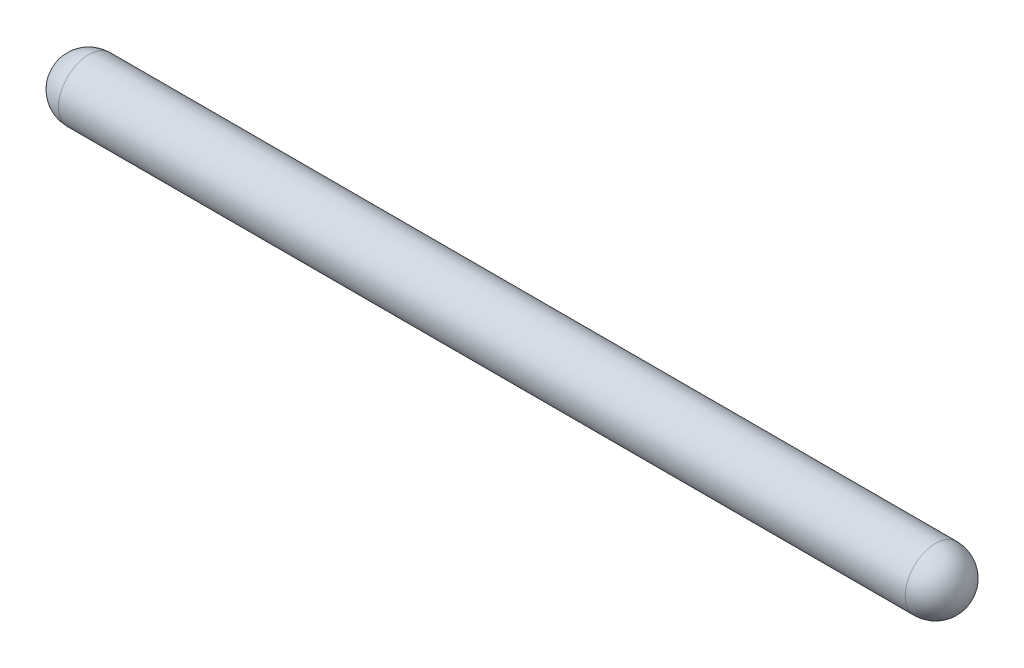
ISO-10303-21;
HEADER;
FILE_DESCRIPTION(('STEP AP214'),'2;1');
FILE_NAME('part.step','',(''),(''),'','','');
FILE_SCHEMA(('AUTOMOTIVE_DESIGN { 1 0 10303 214 1 1 1 1 }'));
ENDSEC;
DATA;
#1=APPLICATION_CONTEXT('core data for automotive mechanical design processes');
#2=APPLICATION_PROTOCOL_DEFINITION('international standard','automotive_design',2000,#1);
#3=PRODUCT_CONTEXT('',#1,'mechanical');
#4=PRODUCT('Part','Part','',(#3));
#5=PRODUCT_RELATED_PRODUCT_CATEGORY('part','',(#4));
#6=PRODUCT_DEFINITION_FORMATION('','',#4);
#7=PRODUCT_DEFINITION_CONTEXT('part definition',#1,'design');
#8=PRODUCT_DEFINITION('design','',#6,#7);
#9=PRODUCT_DEFINITION_SHAPE('','',#8);
#10=(LENGTH_UNIT() NAMED_UNIT(*) SI_UNIT(.MILLI.,.METRE.));
#11=(NAMED_UNIT(*) PLANE_ANGLE_UNIT() SI_UNIT($,.RADIAN.));
#12=(NAMED_UNIT(*) SI_UNIT($,.STERADIAN.) SOLID_ANGLE_UNIT());
#13=UNCERTAINTY_MEASURE_WITH_UNIT(LENGTH_MEASURE(1.E-05),#10,'distance_accuracy_value','');
#14=(GEOMETRIC_REPRESENTATION_CONTEXT(3) GLOBAL_UNCERTAINTY_ASSIGNED_CONTEXT((#13)) GLOBAL_UNIT_ASSIGNED_CONTEXT((#10,
#11,#12)) REPRESENTATION_CONTEXT('',''));
#15=CARTESIAN_POINT('',(0.,0.,0.));
#16=DIRECTION('',(0.,0.,1.));
#17=DIRECTION('',(1.,0.,0.));
#18=AXIS2_PLACEMENT_3D('',#15,#16,#17);
#19=CARTESIAN_POINT('',(-14.,0.,0.));
#20=DIRECTION('',(0.,0.,1.));
#21=DIRECTION('',(1.,0.,0.));
#22=AXIS2_PLACEMENT_3D('',#19,#20,#21);
#23=SPHERICAL_SURFACE('',#22,1.);
#24=CARTESIAN_POINT('',(-14.,0.,0.));
#25=DIRECTION('',(-1.,0.,0.));
#26=DIRECTION('',(0.,0.,1.));
#27=AXIS2_PLACEMENT_3D('',#24,#25,#26);
#28=SPHERICAL_SURFACE('',#27,1.);
#29=CARTESIAN_POINT('',(-14.,0.,0.));
#30=DIRECTION('',(-1.,0.,0.));
#31=DIRECTION('',(0.,0.,1.));
#32=AXIS2_PLACEMENT_3D('',#29,#30,#31);
#33=CIRCLE('',#32,1.);
#34=CARTESIAN_POINT('',(-14.,0.,1.));
#35=VERTEX_POINT('',#34);
#36=EDGE_CURVE('E44',#35,#35,#33,.T.);
#37=ORIENTED_EDGE('',*,*,#36,.T.);
#38=EDGE_LOOP('',(#37));
#39=FACE_BOUND('',#38,.T.);
#40=ADVANCED_FACE('F37',(#39),#28,.T.);
#41=CARTESIAN_POINT('',(14.,0.,0.));
#42=DIRECTION('',(0.,0.,1.));
#43=DIRECTION('',(1.,0.,0.));
#44=AXIS2_PLACEMENT_3D('',#41,#42,#43);
#45=SPHERICAL_SURFACE('',#44,1.);
#46=CARTESIAN_POINT('',(14.,0.,0.));
#47=DIRECTION('',(-1.,0.,0.));
#48=DIRECTION('',(0.,0.,1.));
#49=AXIS2_PLACEMENT_3D('',#46,#47,#48);
#50=SPHERICAL_SURFACE('',#49,1.);
#51=CARTESIAN_POINT('',(14.,0.,0.));
#52=DIRECTION('',(-1.,0.,0.));
#53=DIRECTION('',(0.,0.,1.));
#54=AXIS2_PLACEMENT_3D('',#51,#52,#53);
#55=CIRCLE('',#54,1.);
#56=CARTESIAN_POINT('',(14.,0.,1.));
#57=VERTEX_POINT('',#56);
#58=EDGE_CURVE('E10',#57,#57,#55,.T.);
#59=ORIENTED_EDGE('',*,*,#58,.F.);
#60=EDGE_LOOP('',(#59));
#61=FACE_BOUND('',#60,.T.);
#62=ADVANCED_FACE('F39',(#61),#50,.T.);
#63=CARTESIAN_POINT('',(-14.,0.,0.));
#64=DIRECTION('',(-1.,0.,0.));
#65=DIRECTION('',(0.,0.,1.));
#66=AXIS2_PLACEMENT_3D('',#63,#64,#65);
#67=CYLINDRICAL_SURFACE('',#66,1.);
#68=ORIENTED_EDGE('',*,*,#36,.F.);
#69=EDGE_LOOP('',(#68));
#70=FACE_BOUND('',#69,.T.);
#71=ORIENTED_EDGE('',*,*,#58,.T.);
#72=EDGE_LOOP('',(#71));
#73=FACE_BOUND('',#72,.T.);
#74=ADVANCED_FACE('F51',(#70,#73),#67,.T.);
#75=CLOSED_SHELL('',(#40,#62,#74));
#76=MANIFOLD_SOLID_BREP('B2',#75);
#77=ADVANCED_BREP_SHAPE_REPRESENTATION('',(#18,#76),#14);
#78=SHAPE_DEFINITION_REPRESENTATION(#9,#77);
ENDSEC;
END-ISO-10303-21;
